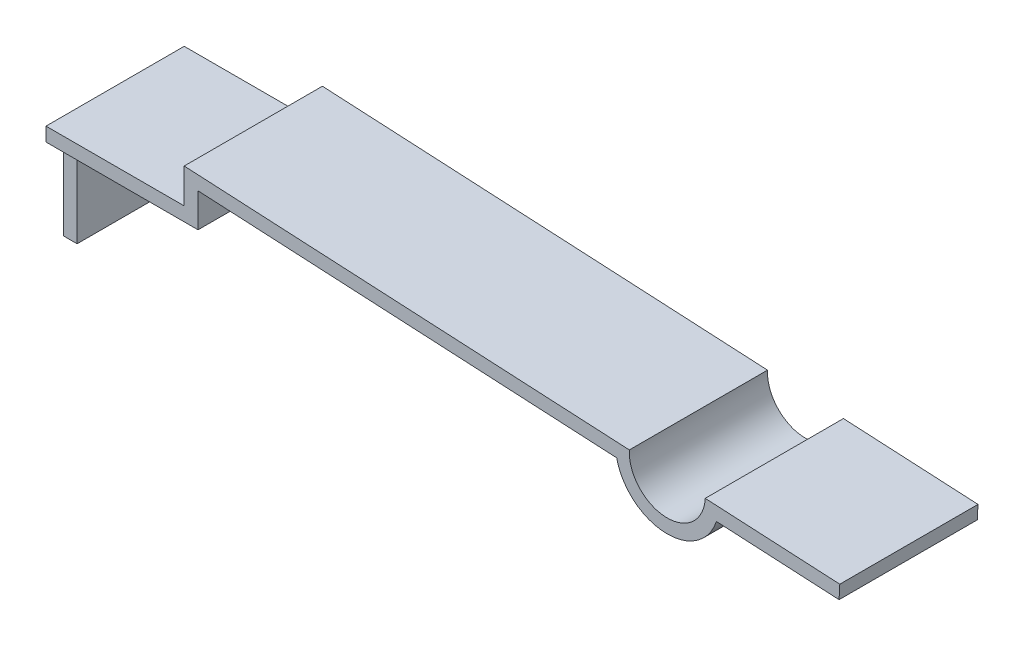
ISO-10303-21;
HEADER;
FILE_DESCRIPTION(('STEP AP214'),'2;1');
FILE_NAME('part.step','',(''),(''),'','','');
FILE_SCHEMA(('AUTOMOTIVE_DESIGN { 1 0 10303 214 1 1 1 1 }'));
ENDSEC;
DATA;
#1=APPLICATION_CONTEXT('core data for automotive mechanical design processes');
#2=APPLICATION_PROTOCOL_DEFINITION('international standard','automotive_design',2000,#1);
#3=PRODUCT_CONTEXT('',#1,'mechanical');
#4=PRODUCT('Part','Part','',(#3));
#5=PRODUCT_RELATED_PRODUCT_CATEGORY('part','',(#4));
#6=PRODUCT_DEFINITION_FORMATION('','',#4);
#7=PRODUCT_DEFINITION_CONTEXT('part definition',#1,'design');
#8=PRODUCT_DEFINITION('design','',#6,#7);
#9=PRODUCT_DEFINITION_SHAPE('','',#8);
#10=(LENGTH_UNIT() NAMED_UNIT(*) SI_UNIT(.MILLI.,.METRE.));
#11=(NAMED_UNIT(*) PLANE_ANGLE_UNIT() SI_UNIT($,.RADIAN.));
#12=(NAMED_UNIT(*) SI_UNIT($,.STERADIAN.) SOLID_ANGLE_UNIT());
#13=UNCERTAINTY_MEASURE_WITH_UNIT(LENGTH_MEASURE(1.E-05),#10,'distance_accuracy_value','');
#14=(GEOMETRIC_REPRESENTATION_CONTEXT(3) GLOBAL_UNCERTAINTY_ASSIGNED_CONTEXT((#13)) GLOBAL_UNIT_ASSIGNED_CONTEXT((#10,
#11,#12)) REPRESENTATION_CONTEXT('',''));
#15=CARTESIAN_POINT('',(0.,0.,0.));
#16=DIRECTION('',(0.,0.,1.));
#17=DIRECTION('',(1.,0.,0.));
#18=AXIS2_PLACEMENT_3D('',#15,#16,#17);
#19=CARTESIAN_POINT('',(0.0156649245683257,0.298904566891153,2.));
#20=DIRECTION('',(0.0523359562429474,0.998629534754574,0.));
#21=DIRECTION('',(-0.998629534754574,0.0523359562429474,0.));
#22=AXIS2_PLACEMENT_3D('',#19,#20,#21);
#23=PLANE('',#22);
#24=DIRECTION('',(0.998629534754574,-0.0523359562429474,0.));
#25=VECTOR('',#24,1.);
#26=CARTESIAN_POINT('',(0.0156649245683257,0.298904566891153,0.));
#27=LINE('',#26,#25);
#28=CARTESIAN_POINT('',(0.2,0.289243974943807,0.));
#29=VERTEX_POINT('',#28);
#30=CARTESIAN_POINT('',(6.25808856660433,-0.0282469935319298,0.));
#31=VERTEX_POINT('',#30);
#32=EDGE_CURVE('E168',#29,#31,#27,.T.);
#33=ORIENTED_EDGE('',*,*,#32,.T.);
#34=DIRECTION('',(0.,0.,-1.));
#35=VECTOR('',#34,1.);
#36=CARTESIAN_POINT('',(6.25808856660433,-0.0282469935319298,2.));
#37=LINE('',#36,#35);
#38=CARTESIAN_POINT('',(6.25808856660433,-0.0282469935319298,2.));
#39=VERTEX_POINT('',#38);
#40=EDGE_CURVE('E11',#39,#31,#37,.T.);
#41=ORIENTED_EDGE('',*,*,#40,.F.);
#42=DIRECTION('',(0.998629534754574,-0.0523359562429474,0.));
#43=VECTOR('',#42,1.);
#44=CARTESIAN_POINT('',(0.0156649245683257,0.298904566891153,2.));
#45=LINE('',#44,#43);
#46=CARTESIAN_POINT('',(0.2,0.289243974943807,2.));
#47=VERTEX_POINT('',#46);
#48=EDGE_CURVE('E197',#47,#39,#45,.T.);
#49=ORIENTED_EDGE('',*,*,#48,.F.);
#50=DIRECTION('',(0.,0.,-1.));
#51=VECTOR('',#50,1.);
#52=CARTESIAN_POINT('',(0.2,0.289243974943807,2.));
#53=LINE('',#52,#51);
#54=EDGE_CURVE('E167',#47,#29,#53,.T.);
#55=ORIENTED_EDGE('',*,*,#54,.T.);
#56=EDGE_LOOP('',(#33,#41,#49,#55));
#57=FACE_BOUND('',#56,.T.);
#58=ADVANCED_FACE('F35',(#57),#23,.F.);
#59=CARTESIAN_POINT('',(6.99040674328202,0.133648306299368,2.));
#60=DIRECTION('',(0.,0.,-1.));
#61=DIRECTION('',(-1.,0.,0.));
#62=AXIS2_PLACEMENT_3D('',#59,#60,#61);
#63=CYLINDRICAL_SURFACE('',#62,0.75);
#64=CARTESIAN_POINT('',(6.99040674328202,0.133648306299368,0.));
#65=DIRECTION('',(0.,0.,1.));
#66=DIRECTION('',(1.,0.,0.));
#67=AXIS2_PLACEMENT_3D('',#64,#65,#66);
#68=CIRCLE('',#67,0.75);
#69=CARTESIAN_POINT('',(7.70179053746253,-0.103908207771163,0.));
#70=VERTEX_POINT('',#69);
#71=EDGE_CURVE('E171',#31,#70,#68,.T.);
#72=ORIENTED_EDGE('',*,*,#71,.T.);
#73=DIRECTION('',(0.,0.,-1.));
#74=VECTOR('',#73,1.);
#75=CARTESIAN_POINT('',(7.70179053746253,-0.103908207771163,2.));
#76=LINE('',#75,#74);
#77=CARTESIAN_POINT('',(7.70179053746253,-0.103908207771163,2.));
#78=VERTEX_POINT('',#77);
#79=EDGE_CURVE('E42',#78,#70,#76,.T.);
#80=ORIENTED_EDGE('',*,*,#79,.F.);
#81=CARTESIAN_POINT('',(6.99040674328202,0.133648306299368,2.));
#82=DIRECTION('',(0.,0.,1.));
#83=DIRECTION('',(1.,0.,0.));
#84=AXIS2_PLACEMENT_3D('',#81,#82,#83);
#85=CIRCLE('',#84,0.75);
#86=EDGE_CURVE('E107',#39,#78,#85,.T.);
#87=ORIENTED_EDGE('',*,*,#86,.F.);
#88=ORIENTED_EDGE('',*,*,#40,.T.);
#89=EDGE_LOOP('',(#72,#80,#87,#88));
#90=FACE_BOUND('',#89,.T.);
#91=ADVANCED_FACE('F289',(#90),#63,.T.);
#92=CARTESIAN_POINT('',(0.0156649245683257,0.298904566891154,2.));
#93=DIRECTION('',(0.0523359562429474,0.998629534754574,0.));
#94=DIRECTION('',(-0.998629534754574,0.0523359562429474,0.));
#95=AXIS2_PLACEMENT_3D('',#92,#93,#94);
#96=PLANE('',#95);
#97=DIRECTION('',(0.998629534754574,-0.0523359562429474,0.));
#98=VECTOR('',#97,1.);
#99=CARTESIAN_POINT('',(0.0156649245683257,0.298904566891154,0.));
#100=LINE('',#99,#98);
#101=CARTESIAN_POINT('',(9.47651338891986,-0.196917491258915,0.));
#102=VERTEX_POINT('',#101);
#103=EDGE_CURVE('E174',#70,#102,#100,.T.);
#104=ORIENTED_EDGE('',*,*,#103,.T.);
#105=DIRECTION('',(0.,0.,-1.));
#106=VECTOR('',#105,1.);
#107=CARTESIAN_POINT('',(9.47651338891986,-0.196917491258915,2.));
#108=LINE('',#107,#106);
#109=CARTESIAN_POINT('',(9.47651338891986,-0.196917491258915,2.));
#110=VERTEX_POINT('',#109);
#111=EDGE_CURVE('E218',#110,#102,#108,.T.);
#112=ORIENTED_EDGE('',*,*,#111,.F.);
#113=DIRECTION('',(0.998629534754574,-0.0523359562429474,0.));
#114=VECTOR('',#113,1.);
#115=CARTESIAN_POINT('',(0.0156649245683257,0.298904566891154,2.));
#116=LINE('',#115,#114);
#117=EDGE_CURVE('E225',#78,#110,#116,.T.);
#118=ORIENTED_EDGE('',*,*,#117,.F.);
#119=ORIENTED_EDGE('',*,*,#79,.T.);
#120=EDGE_LOOP('',(#104,#112,#118,#119));
#121=FACE_BOUND('',#120,.T.);
#122=ADVANCED_FACE('F223',(#121),#96,.F.);
#123=CARTESIAN_POINT('',(9.46084846435153,-0.495822058150093,2.));
#124=DIRECTION('',(0.998629534754574,-0.05233595624295,0.));
#125=DIRECTION('',(0.05233595624295,0.998629534754574,0.));
#126=AXIS2_PLACEMENT_3D('',#123,#124,#125);
#127=PLANE('',#126);
#128=DIRECTION('',(-0.05233595624295,-0.998629534754574,0.));
#129=VECTOR('',#128,1.);
#130=CARTESIAN_POINT('',(9.46084846435153,-0.495822058150093,0.));
#131=LINE('',#130,#129);
#132=CARTESIAN_POINT('',(9.48698058016845,0.00280841569199968,0.));
#133=VERTEX_POINT('',#132);
#134=EDGE_CURVE('E177',#133,#102,#131,.T.);
#135=ORIENTED_EDGE('',*,*,#134,.F.);
#136=DIRECTION('',(0.,0.,-1.));
#137=VECTOR('',#136,1.);
#138=CARTESIAN_POINT('',(9.48698058016845,0.00280841569199968,2.));
#139=LINE('',#138,#137);
#140=CARTESIAN_POINT('',(9.48698058016845,0.00280841569199968,2.));
#141=VERTEX_POINT('',#140);
#142=EDGE_CURVE('E216',#141,#133,#139,.T.);
#143=ORIENTED_EDGE('',*,*,#142,.F.);
#144=DIRECTION('',(-0.05233595624295,-0.998629534754574,0.));
#145=VECTOR('',#144,1.);
#146=CARTESIAN_POINT('',(9.46084846435153,-0.495822058150093,2.));
#147=LINE('',#146,#145);
#148=EDGE_CURVE('E234',#141,#110,#147,.T.);
#149=ORIENTED_EDGE('',*,*,#148,.T.);
#150=ORIENTED_EDGE('',*,*,#111,.T.);
#151=EDGE_LOOP('',(#135,#143,#149,#150));
#152=FACE_BOUND('',#151,.T.);
#153=ADVANCED_FACE('F231',(#152),#127,.T.);
#154=CARTESIAN_POINT('',(0.0261321158169152,0.498630473842069,2.));
#155=DIRECTION('',(0.0523359562429474,0.998629534754574,0.));
#156=DIRECTION('',(-0.998629534754574,0.0523359562429474,0.));
#157=AXIS2_PLACEMENT_3D('',#154,#155,#156);
#158=PLANE('',#157);
#159=DIRECTION('',(0.998629534754574,-0.0523359562429474,0.));
#160=VECTOR('',#159,1.);
#161=CARTESIAN_POINT('',(0.0261321158169152,0.498630473842069,0.));
#162=LINE('',#161,#160);
#163=CARTESIAN_POINT('',(7.53965298739703,0.104863530365747,0.));
#164=VERTEX_POINT('',#163);
#165=EDGE_CURVE('E180',#164,#133,#162,.T.);
#166=ORIENTED_EDGE('',*,*,#165,.F.);
#167=DIRECTION('',(0.,0.,-1.));
#168=VECTOR('',#167,1.);
#169=CARTESIAN_POINT('',(7.53965298739703,0.104863530365747,2.));
#170=LINE('',#169,#168);
#171=CARTESIAN_POINT('',(7.53965298739703,0.104863530365747,2.));
#172=VERTEX_POINT('',#171);
#173=EDGE_CURVE('E214',#172,#164,#170,.T.);
#174=ORIENTED_EDGE('',*,*,#173,.F.);
#175=DIRECTION('',(0.998629534754574,-0.0523359562429474,0.));
#176=VECTOR('',#175,1.);
#177=CARTESIAN_POINT('',(0.0261321158169152,0.498630473842069,2.));
#178=LINE('',#177,#176);
#179=EDGE_CURVE('E237',#172,#141,#178,.T.);
#180=ORIENTED_EDGE('',*,*,#179,.T.);
#181=ORIENTED_EDGE('',*,*,#142,.T.);
#182=EDGE_LOOP('',(#166,#174,#180,#181));
#183=FACE_BOUND('',#182,.T.);
#184=ADVANCED_FACE('F299',(#183),#158,.T.);
#185=CARTESIAN_POINT('',(6.99040674328202,0.133648306299368,2.));
#186=DIRECTION('',(0.,0.,-1.));
#187=DIRECTION('',(-1.,0.,0.));
#188=AXIS2_PLACEMENT_3D('',#185,#186,#187);
#189=CYLINDRICAL_SURFACE('',#188,0.55);
#190=CARTESIAN_POINT('',(6.99040674328202,0.133648306299368,0.));
#191=DIRECTION('',(0.,0.,1.));
#192=DIRECTION('',(1.,0.,0.));
#193=AXIS2_PLACEMENT_3D('',#190,#191,#192);
#194=CIRCLE('',#193,0.55);
#195=CARTESIAN_POINT('',(6.441160499167,0.162433082232989,0.));
#196=VERTEX_POINT('',#195);
#197=EDGE_CURVE('E183',#196,#164,#194,.T.);
#198=ORIENTED_EDGE('',*,*,#197,.F.);
#199=DIRECTION('',(0.,0.,-1.));
#200=VECTOR('',#199,1.);
#201=CARTESIAN_POINT('',(6.441160499167,0.162433082232989,2.));
#202=LINE('',#201,#200);
#203=CARTESIAN_POINT('',(6.441160499167,0.162433082232989,2.));
#204=VERTEX_POINT('',#203);
#205=EDGE_CURVE('E212',#204,#196,#202,.T.);
#206=ORIENTED_EDGE('',*,*,#205,.F.);
#207=CARTESIAN_POINT('',(6.99040674328202,0.133648306299368,2.));
#208=DIRECTION('',(0.,0.,1.));
#209=DIRECTION('',(1.,0.,0.));
#210=AXIS2_PLACEMENT_3D('',#207,#208,#209);
#211=CIRCLE('',#210,0.55);
#212=EDGE_CURVE('E239',#204,#172,#211,.T.);
#213=ORIENTED_EDGE('',*,*,#212,.T.);
#214=ORIENTED_EDGE('',*,*,#173,.T.);
#215=EDGE_LOOP('',(#198,#206,#213,#214));
#216=FACE_BOUND('',#215,.T.);
#217=ADVANCED_FACE('F302',(#216),#189,.F.);
#218=CARTESIAN_POINT('',(0.0261321158169151,0.498630473842068,2.));
#219=DIRECTION('',(0.0523359562429474,0.998629534754574,0.));
#220=DIRECTION('',(-0.998629534754574,0.0523359562429474,0.));
#221=AXIS2_PLACEMENT_3D('',#218,#219,#220);
#222=PLANE('',#221);
#223=DIRECTION('',(0.998629534754574,-0.0523359562429474,0.));
#224=VECTOR('',#223,1.);
#225=CARTESIAN_POINT('',(0.0261321158169151,0.498630473842068,0.));
#226=LINE('',#225,#224);
#227=CARTESIAN_POINT('',(0.,0.5,0.));
#228=VERTEX_POINT('',#227);
#229=EDGE_CURVE('E186',#228,#196,#226,.T.);
#230=ORIENTED_EDGE('',*,*,#229,.F.);
#231=DIRECTION('',(0.,0.,-1.));
#232=VECTOR('',#231,1.);
#233=CARTESIAN_POINT('',(0.,0.5,2.));
#234=LINE('',#233,#232);
#235=CARTESIAN_POINT('',(0.,0.5,2.));
#236=VERTEX_POINT('',#235);
#237=EDGE_CURVE('E210',#236,#228,#234,.T.);
#238=ORIENTED_EDGE('',*,*,#237,.F.);
#239=DIRECTION('',(0.998629534754574,-0.0523359562429474,0.));
#240=VECTOR('',#239,1.);
#241=CARTESIAN_POINT('',(0.0261321158169151,0.498630473842068,2.));
#242=LINE('',#241,#240);
#243=EDGE_CURVE('E246',#236,#204,#242,.T.);
#244=ORIENTED_EDGE('',*,*,#243,.T.);
#245=ORIENTED_EDGE('',*,*,#205,.T.);
#246=EDGE_LOOP('',(#230,#238,#244,#245));
#247=FACE_BOUND('',#246,.T.);
#248=ADVANCED_FACE('F306',(#247),#222,.T.);
#249=CARTESIAN_POINT('',(0.,0.,2.));
#250=DIRECTION('',(-1.,0.,0.));
#251=DIRECTION('',(0.,0.,1.));
#252=AXIS2_PLACEMENT_3D('',#249,#250,#251);
#253=PLANE('',#252);
#254=DIRECTION('',(0.,1.,0.));
#255=VECTOR('',#254,1.);
#256=CARTESIAN_POINT('',(0.,0.,0.));
#257=LINE('',#256,#255);
#258=CARTESIAN_POINT('',(0.,0.,0.));
#259=VERTEX_POINT('',#258);
#260=EDGE_CURVE('E189',#259,#228,#257,.T.);
#261=ORIENTED_EDGE('',*,*,#260,.F.);
#262=DIRECTION('',(0.,0.,-1.));
#263=VECTOR('',#262,1.);
#264=CARTESIAN_POINT('',(0.,0.,2.));
#265=LINE('',#264,#263);
#266=CARTESIAN_POINT('',(0.,0.,2.));
#267=VERTEX_POINT('',#266);
#268=EDGE_CURVE('E151',#267,#259,#265,.T.);
#269=ORIENTED_EDGE('',*,*,#268,.F.);
#270=DIRECTION('',(0.,1.,0.));
#271=VECTOR('',#270,1.);
#272=CARTESIAN_POINT('',(0.,0.,2.));
#273=LINE('',#272,#271);
#274=EDGE_CURVE('E141',#267,#236,#273,.T.);
#275=ORIENTED_EDGE('',*,*,#274,.T.);
#276=ORIENTED_EDGE('',*,*,#237,.T.);
#277=EDGE_LOOP('',(#261,#269,#275,#276));
#278=FACE_BOUND('',#277,.T.);
#279=ADVANCED_FACE('F250',(#278),#253,.T.);
#280=CARTESIAN_POINT('',(0.,0.,2.));
#281=DIRECTION('',(0.,-1.,0.));
#282=DIRECTION('',(1.,0.,0.));
#283=AXIS2_PLACEMENT_3D('',#280,#281,#282);
#284=PLANE('',#283);
#285=DIRECTION('',(-1.,0.,0.));
#286=VECTOR('',#285,1.);
#287=CARTESIAN_POINT('',(0.,0.,0.));
#288=LINE('',#287,#286);
#289=CARTESIAN_POINT('',(-2.,0.,0.));
#290=VERTEX_POINT('',#289);
#291=EDGE_CURVE('E148',#259,#290,#288,.T.);
#292=ORIENTED_EDGE('',*,*,#291,.T.);
#293=DIRECTION('',(0.,0.,-1.));
#294=VECTOR('',#293,1.);
#295=CARTESIAN_POINT('',(-2.,0.,2.));
#296=LINE('',#295,#294);
#297=CARTESIAN_POINT('',(-2.,0.,2.));
#298=VERTEX_POINT('',#297);
#299=EDGE_CURVE('E145',#298,#290,#296,.T.);
#300=ORIENTED_EDGE('',*,*,#299,.F.);
#301=DIRECTION('',(-1.,0.,0.));
#302=VECTOR('',#301,1.);
#303=CARTESIAN_POINT('',(0.,0.,2.));
#304=LINE('',#303,#302);
#305=EDGE_CURVE('E134',#267,#298,#304,.T.);
#306=ORIENTED_EDGE('',*,*,#305,.F.);
#307=ORIENTED_EDGE('',*,*,#268,.T.);
#308=EDGE_LOOP('',(#292,#300,#306,#307));
#309=FACE_BOUND('',#308,.T.);
#310=ADVANCED_FACE('F146',(#309),#284,.F.);
#311=CARTESIAN_POINT('',(-2.,0.,2.));
#312=DIRECTION('',(1.,0.,0.));
#313=DIRECTION('',(0.,1.,0.));
#314=AXIS2_PLACEMENT_3D('',#311,#312,#313);
#315=PLANE('',#314);
#316=DIRECTION('',(0.,0.,1.));
#317=VECTOR('',#316,1.);
#318=CARTESIAN_POINT('',(-2.,-0.2,0.));
#319=LINE('',#318,#317);
#320=CARTESIAN_POINT('',(-2.,-0.2,0.));
#321=VERTEX_POINT('',#320);
#322=CARTESIAN_POINT('',(-2.,-0.2,0.25));
#323=VERTEX_POINT('',#322);
#324=EDGE_CURVE('E254',#321,#323,#319,.T.);
#325=ORIENTED_EDGE('',*,*,#324,.T.);
#326=DIRECTION('',(0.,-1.,0.));
#327=VECTOR('',#326,1.);
#328=CARTESIAN_POINT('',(-2.,-1.5,0.25));
#329=LINE('',#328,#327);
#330=CARTESIAN_POINT('',(-2.,-1.5,0.25));
#331=VERTEX_POINT('',#330);
#332=EDGE_CURVE('E258',#323,#331,#329,.T.);
#333=ORIENTED_EDGE('',*,*,#332,.T.);
#334=DIRECTION('',(0.,0.,-1.));
#335=VECTOR('',#334,1.);
#336=CARTESIAN_POINT('',(-2.,-1.5,2.));
#337=LINE('',#336,#335);
#338=CARTESIAN_POINT('',(-2.,-1.5,1.75));
#339=VERTEX_POINT('',#338);
#340=EDGE_CURVE('E152',#339,#331,#337,.T.);
#341=ORIENTED_EDGE('',*,*,#340,.F.);
#342=DIRECTION('',(0.,1.,0.));
#343=VECTOR('',#342,1.);
#344=CARTESIAN_POINT('',(-2.,-1.5,1.75));
#345=LINE('',#344,#343);
#346=CARTESIAN_POINT('',(-2.,-0.2,1.75));
#347=VERTEX_POINT('',#346);
#348=EDGE_CURVE('E276',#339,#347,#345,.T.);
#349=ORIENTED_EDGE('',*,*,#348,.T.);
#350=DIRECTION('',(0.,0.,1.));
#351=VECTOR('',#350,1.);
#352=CARTESIAN_POINT('',(-2.,-0.2,2.));
#353=LINE('',#352,#351);
#354=CARTESIAN_POINT('',(-2.,-0.2,2.));
#355=VERTEX_POINT('',#354);
#356=EDGE_CURVE('E159',#347,#355,#353,.T.);
#357=ORIENTED_EDGE('',*,*,#356,.T.);
#358=DIRECTION('',(0.,-1.,0.));
#359=VECTOR('',#358,1.);
#360=CARTESIAN_POINT('',(-2.,0.,2.));
#361=LINE('',#360,#359);
#362=EDGE_CURVE('E138',#298,#355,#361,.T.);
#363=ORIENTED_EDGE('',*,*,#362,.F.);
#364=ORIENTED_EDGE('',*,*,#299,.T.);
#365=DIRECTION('',(0.,-1.,0.));
#366=VECTOR('',#365,1.);
#367=CARTESIAN_POINT('',(-2.,0.,0.));
#368=LINE('',#367,#366);
#369=EDGE_CURVE('E193',#290,#321,#368,.T.);
#370=ORIENTED_EDGE('',*,*,#369,.T.);
#371=EDGE_LOOP('',(#325,#333,#341,#349,#357,#363,#364,#370));
#372=FACE_BOUND('',#371,.T.);
#373=ADVANCED_FACE('F156',(#372),#315,.F.);
#374=CARTESIAN_POINT('',(0.,-1.5,2.));
#375=DIRECTION('',(0.,1.,0.));
#376=DIRECTION('',(0.,0.,1.));
#377=AXIS2_PLACEMENT_3D('',#374,#375,#376);
#378=PLANE('',#377);
#379=ORIENTED_EDGE('',*,*,#340,.T.);
#380=DIRECTION('',(1.,0.,0.));
#381=VECTOR('',#380,1.);
#382=CARTESIAN_POINT('',(-2.,-1.5,0.25));
#383=LINE('',#382,#381);
#384=CARTESIAN_POINT('',(-1.8,-1.5,0.25));
#385=VERTEX_POINT('',#384);
#386=EDGE_CURVE('E270',#331,#385,#383,.T.);
#387=ORIENTED_EDGE('',*,*,#386,.T.);
#388=DIRECTION('',(0.,0.,-1.));
#389=VECTOR('',#388,1.);
#390=CARTESIAN_POINT('',(-1.8,-1.5,2.));
#391=LINE('',#390,#389);
#392=CARTESIAN_POINT('',(-1.8,-1.5,1.75));
#393=VERTEX_POINT('',#392);
#394=EDGE_CURVE('E204',#393,#385,#391,.T.);
#395=ORIENTED_EDGE('',*,*,#394,.F.);
#396=DIRECTION('',(1.,0.,0.));
#397=VECTOR('',#396,1.);
#398=CARTESIAN_POINT('',(-2.,-1.5,1.75));
#399=LINE('',#398,#397);
#400=EDGE_CURVE('E279',#339,#393,#399,.T.);
#401=ORIENTED_EDGE('',*,*,#400,.F.);
#402=EDGE_LOOP('',(#379,#387,#395,#401));
#403=FACE_BOUND('',#402,.T.);
#404=ADVANCED_FACE('F317',(#403),#378,.F.);
#405=CARTESIAN_POINT('',(-1.8,0.,2.));
#406=DIRECTION('',(1.,0.,0.));
#407=DIRECTION('',(0.,0.,-1.));
#408=AXIS2_PLACEMENT_3D('',#405,#406,#407);
#409=PLANE('',#408);
#410=DIRECTION('',(0.,-1.,0.));
#411=VECTOR('',#410,1.);
#412=CARTESIAN_POINT('',(-1.8,-1.5,0.25));
#413=LINE('',#412,#411);
#414=CARTESIAN_POINT('',(-1.8,-0.2,0.25));
#415=VERTEX_POINT('',#414);
#416=EDGE_CURVE('E263',#415,#385,#413,.T.);
#417=ORIENTED_EDGE('',*,*,#416,.F.);
#418=DIRECTION('',(0.,0.,-1.));
#419=VECTOR('',#418,1.);
#420=CARTESIAN_POINT('',(-1.8,-0.2,2.));
#421=LINE('',#420,#419);
#422=CARTESIAN_POINT('',(-1.8,-0.2,1.75));
#423=VERTEX_POINT('',#422);
#424=EDGE_CURVE('E201',#423,#415,#421,.T.);
#425=ORIENTED_EDGE('',*,*,#424,.F.);
#426=DIRECTION('',(0.,1.,0.));
#427=VECTOR('',#426,1.);
#428=CARTESIAN_POINT('',(-1.8,-1.5,1.75));
#429=LINE('',#428,#427);
#430=EDGE_CURVE('E273',#393,#423,#429,.T.);
#431=ORIENTED_EDGE('',*,*,#430,.F.);
#432=ORIENTED_EDGE('',*,*,#394,.T.);
#433=EDGE_LOOP('',(#417,#425,#431,#432));
#434=FACE_BOUND('',#433,.T.);
#435=ADVANCED_FACE('F320',(#434),#409,.T.);
#436=CARTESIAN_POINT('',(0.,-0.2,2.));
#437=DIRECTION('',(0.,-1.,0.));
#438=DIRECTION('',(1.,0.,0.));
#439=AXIS2_PLACEMENT_3D('',#436,#437,#438);
#440=PLANE('',#439);
#441=DIRECTION('',(-1.,0.,0.));
#442=VECTOR('',#441,1.);
#443=CARTESIAN_POINT('',(0.,-0.2,0.));
#444=LINE('',#443,#442);
#445=CARTESIAN_POINT('',(0.2,-0.2,0.));
#446=VERTEX_POINT('',#445);
#447=EDGE_CURVE('E49',#446,#321,#444,.T.);
#448=ORIENTED_EDGE('',*,*,#447,.F.);
#449=DIRECTION('',(0.,0.,-1.));
#450=VECTOR('',#449,1.);
#451=CARTESIAN_POINT('',(0.2,-0.2,2.));
#452=LINE('',#451,#450);
#453=CARTESIAN_POINT('',(0.2,-0.2,2.));
#454=VERTEX_POINT('',#453);
#455=EDGE_CURVE('E199',#454,#446,#452,.T.);
#456=ORIENTED_EDGE('',*,*,#455,.F.);
#457=DIRECTION('',(-1.,0.,0.));
#458=VECTOR('',#457,1.);
#459=CARTESIAN_POINT('',(0.,-0.2,2.));
#460=LINE('',#459,#458);
#461=EDGE_CURVE('E160',#454,#355,#460,.T.);
#462=ORIENTED_EDGE('',*,*,#461,.T.);
#463=ORIENTED_EDGE('',*,*,#356,.F.);
#464=DIRECTION('',(1.,0.,0.));
#465=VECTOR('',#464,1.);
#466=CARTESIAN_POINT('',(-2.,-0.2,1.75));
#467=LINE('',#466,#465);
#468=EDGE_CURVE('E172',#347,#423,#467,.T.);
#469=ORIENTED_EDGE('',*,*,#468,.T.);
#470=ORIENTED_EDGE('',*,*,#424,.T.);
#471=DIRECTION('',(1.,0.,0.));
#472=VECTOR('',#471,1.);
#473=CARTESIAN_POINT('',(-2.,-0.2,0.25));
#474=LINE('',#473,#472);
#475=EDGE_CURVE('E265',#323,#415,#474,.T.);
#476=ORIENTED_EDGE('',*,*,#475,.F.);
#477=ORIENTED_EDGE('',*,*,#324,.F.);
#478=EDGE_LOOP('',(#448,#456,#462,#463,#469,#470,#476,#477));
#479=FACE_BOUND('',#478,.T.);
#480=ADVANCED_FACE('F324',(#479),#440,.T.);
#481=CARTESIAN_POINT('',(0.2,0.,2.));
#482=DIRECTION('',(-1.,0.,0.));
#483=DIRECTION('',(0.,0.,1.));
#484=AXIS2_PLACEMENT_3D('',#481,#482,#483);
#485=PLANE('',#484);
#486=DIRECTION('',(0.,1.,0.));
#487=VECTOR('',#486,1.);
#488=CARTESIAN_POINT('',(0.2,0.,0.));
#489=LINE('',#488,#487);
#490=EDGE_CURVE('E99',#446,#29,#489,.T.);
#491=ORIENTED_EDGE('',*,*,#490,.T.);
#492=ORIENTED_EDGE('',*,*,#54,.F.);
#493=DIRECTION('',(0.,1.,0.));
#494=VECTOR('',#493,1.);
#495=CARTESIAN_POINT('',(0.2,0.,2.));
#496=LINE('',#495,#494);
#497=EDGE_CURVE('E58',#454,#47,#496,.T.);
#498=ORIENTED_EDGE('',*,*,#497,.F.);
#499=ORIENTED_EDGE('',*,*,#455,.T.);
#500=EDGE_LOOP('',(#491,#492,#498,#499));
#501=FACE_BOUND('',#500,.T.);
#502=ADVANCED_FACE('F328',(#501),#485,.F.);
#503=CARTESIAN_POINT('',(0.,0.,2.));
#504=DIRECTION('',(0.,0.,1.));
#505=DIRECTION('',(1.,0.,0.));
#506=AXIS2_PLACEMENT_3D('',#503,#504,#505);
#507=PLANE('',#506);
#508=ORIENTED_EDGE('',*,*,#362,.T.);
#509=ORIENTED_EDGE('',*,*,#461,.F.);
#510=ORIENTED_EDGE('',*,*,#497,.T.);
#511=ORIENTED_EDGE('',*,*,#48,.T.);
#512=ORIENTED_EDGE('',*,*,#86,.T.);
#513=ORIENTED_EDGE('',*,*,#117,.T.);
#514=ORIENTED_EDGE('',*,*,#148,.F.);
#515=ORIENTED_EDGE('',*,*,#179,.F.);
#516=ORIENTED_EDGE('',*,*,#212,.F.);
#517=ORIENTED_EDGE('',*,*,#243,.F.);
#518=ORIENTED_EDGE('',*,*,#274,.F.);
#519=ORIENTED_EDGE('',*,*,#305,.T.);
#520=EDGE_LOOP('',(#508,#509,#510,#511,#512,#513,#514,#515,#516,#517,#518,#519));
#521=FACE_BOUND('',#520,.T.);
#522=ADVANCED_FACE('F136',(#521),#507,.T.);
#523=CARTESIAN_POINT('',(0.,0.,0.));
#524=DIRECTION('',(0.,0.,1.));
#525=DIRECTION('',(1.,0.,0.));
#526=AXIS2_PLACEMENT_3D('',#523,#524,#525);
#527=PLANE('',#526);
#528=ORIENTED_EDGE('',*,*,#447,.T.);
#529=ORIENTED_EDGE('',*,*,#369,.F.);
#530=ORIENTED_EDGE('',*,*,#291,.F.);
#531=ORIENTED_EDGE('',*,*,#260,.T.);
#532=ORIENTED_EDGE('',*,*,#229,.T.);
#533=ORIENTED_EDGE('',*,*,#197,.T.);
#534=ORIENTED_EDGE('',*,*,#165,.T.);
#535=ORIENTED_EDGE('',*,*,#134,.T.);
#536=ORIENTED_EDGE('',*,*,#103,.F.);
#537=ORIENTED_EDGE('',*,*,#71,.F.);
#538=ORIENTED_EDGE('',*,*,#32,.F.);
#539=ORIENTED_EDGE('',*,*,#490,.F.);
#540=EDGE_LOOP('',(#528,#529,#530,#531,#532,#533,#534,#535,#536,#537,#538,#539));
#541=FACE_BOUND('',#540,.T.);
#542=ADVANCED_FACE('F226',(#541),#527,.F.);
#543=CARTESIAN_POINT('',(-2.,-1.5,1.75));
#544=DIRECTION('',(0.,0.,-1.));
#545=DIRECTION('',(-1.,0.,0.));
#546=AXIS2_PLACEMENT_3D('',#543,#544,#545);
#547=PLANE('',#546);
#548=ORIENTED_EDGE('',*,*,#430,.T.);
#549=ORIENTED_EDGE('',*,*,#468,.F.);
#550=ORIENTED_EDGE('',*,*,#348,.F.);
#551=ORIENTED_EDGE('',*,*,#400,.T.);
#552=EDGE_LOOP('',(#548,#549,#550,#551));
#553=FACE_BOUND('',#552,.T.);
#554=ADVANCED_FACE('F333',(#553),#547,.F.);
#555=CARTESIAN_POINT('',(-2.,-1.5,0.25));
#556=DIRECTION('',(0.,0.,1.));
#557=DIRECTION('',(1.,0.,0.));
#558=AXIS2_PLACEMENT_3D('',#555,#556,#557);
#559=PLANE('',#558);
#560=ORIENTED_EDGE('',*,*,#416,.T.);
#561=ORIENTED_EDGE('',*,*,#386,.F.);
#562=ORIENTED_EDGE('',*,*,#332,.F.);
#563=ORIENTED_EDGE('',*,*,#475,.T.);
#564=EDGE_LOOP('',(#560,#561,#562,#563));
#565=FACE_BOUND('',#564,.T.);
#566=ADVANCED_FACE('F338',(#565),#559,.F.);
#567=CLOSED_SHELL('',(#58,#91,#122,#153,#184,#217,#248,#279,#310,#373,#404,#435,#480,#502,#522,
#542,#554,#566));
#568=MANIFOLD_SOLID_BREP('B2',#567);
#569=ADVANCED_BREP_SHAPE_REPRESENTATION('',(#18,#568),#14);
#570=SHAPE_DEFINITION_REPRESENTATION(#9,#569);
ENDSEC;
END-ISO-10303-21;
